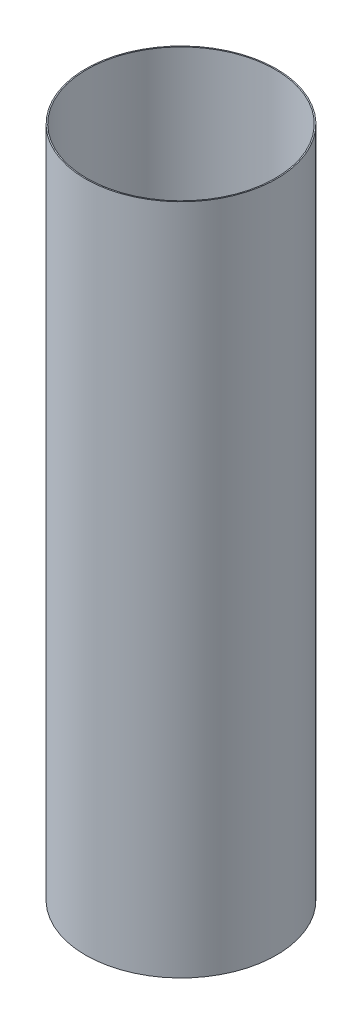
ISO-10303-21;
HEADER;
FILE_DESCRIPTION(('STEP AP214'),'2;1');
FILE_NAME('part.step','',(''),(''),'','','');
FILE_SCHEMA(('AUTOMOTIVE_DESIGN { 1 0 10303 214 1 1 1 1 }'));
ENDSEC;
DATA;
#1=APPLICATION_CONTEXT('core data for automotive mechanical design processes');
#2=APPLICATION_PROTOCOL_DEFINITION('international standard','automotive_design',2000,#1);
#3=PRODUCT_CONTEXT('',#1,'mechanical');
#4=PRODUCT('Part','Part','',(#3));
#5=PRODUCT_RELATED_PRODUCT_CATEGORY('part','',(#4));
#6=PRODUCT_DEFINITION_FORMATION('','',#4);
#7=PRODUCT_DEFINITION_CONTEXT('part definition',#1,'design');
#8=PRODUCT_DEFINITION('design','',#6,#7);
#9=PRODUCT_DEFINITION_SHAPE('','',#8);
#10=(LENGTH_UNIT() NAMED_UNIT(*) SI_UNIT(.MILLI.,.METRE.));
#11=(NAMED_UNIT(*) PLANE_ANGLE_UNIT() SI_UNIT($,.RADIAN.));
#12=(NAMED_UNIT(*) SI_UNIT($,.STERADIAN.) SOLID_ANGLE_UNIT());
#13=UNCERTAINTY_MEASURE_WITH_UNIT(LENGTH_MEASURE(1.E-05),#10,'distance_accuracy_value','');
#14=(GEOMETRIC_REPRESENTATION_CONTEXT(3) GLOBAL_UNCERTAINTY_ASSIGNED_CONTEXT((#13)) GLOBAL_UNIT_ASSIGNED_CONTEXT((#10,
#11,#12)) REPRESENTATION_CONTEXT('',''));
#15=CARTESIAN_POINT('',(0.,0.,0.));
#16=DIRECTION('',(0.,0.,1.));
#17=DIRECTION('',(1.,0.,0.));
#18=AXIS2_PLACEMENT_3D('',#15,#16,#17);
#19=CARTESIAN_POINT('',(0.,595.029544,0.));
#20=DIRECTION('',(0.,1.,0.));
#21=DIRECTION('',(0.,0.,1.));
#22=AXIS2_PLACEMENT_3D('',#19,#20,#21);
#23=PLANE('',#22);
#24=CARTESIAN_POINT('',(0.,595.029544,0.));
#25=DIRECTION('',(0.,1.,0.));
#26=DIRECTION('',(0.,0.,1.));
#27=AXIS2_PLACEMENT_3D('',#24,#25,#26);
#28=CIRCLE('',#27,84.455);
#29=CARTESIAN_POINT('',(0.,595.029544,84.455));
#30=VERTEX_POINT('',#29);
#31=EDGE_CURVE('E10',#30,#30,#28,.T.);
#32=ORIENTED_EDGE('',*,*,#31,.T.);
#33=EDGE_LOOP('',(#32));
#34=FACE_BOUND('',#33,.T.);
#35=CARTESIAN_POINT('',(0.,595.029544,0.));
#36=DIRECTION('',(0.,1.,0.));
#37=DIRECTION('',(0.,0.,1.));
#38=AXIS2_PLACEMENT_3D('',#35,#36,#37);
#39=CIRCLE('',#38,83.439);
#40=CARTESIAN_POINT('',(0.,595.029544,83.439));
#41=VERTEX_POINT('',#40);
#42=EDGE_CURVE('E44',#41,#41,#39,.T.);
#43=ORIENTED_EDGE('',*,*,#42,.F.);
#44=EDGE_LOOP('',(#43));
#45=FACE_BOUND('',#44,.T.);
#46=ADVANCED_FACE('F33',(#34,#45),#23,.T.);
#47=CARTESIAN_POINT('',(0.,0.,0.));
#48=DIRECTION('',(0.,1.,0.));
#49=DIRECTION('',(0.,0.,1.));
#50=AXIS2_PLACEMENT_3D('',#47,#48,#49);
#51=PLANE('',#50);
#52=CARTESIAN_POINT('',(0.,0.,0.));
#53=DIRECTION('',(0.,1.,0.));
#54=DIRECTION('',(0.,0.,1.));
#55=AXIS2_PLACEMENT_3D('',#52,#53,#54);
#56=CIRCLE('',#55,84.455);
#57=CARTESIAN_POINT('',(0.,0.,84.455));
#58=VERTEX_POINT('',#57);
#59=EDGE_CURVE('E37',#58,#58,#56,.T.);
#60=ORIENTED_EDGE('',*,*,#59,.F.);
#61=EDGE_LOOP('',(#60));
#62=FACE_BOUND('',#61,.T.);
#63=CARTESIAN_POINT('',(0.,0.,0.));
#64=DIRECTION('',(0.,1.,0.));
#65=DIRECTION('',(0.,0.,1.));
#66=AXIS2_PLACEMENT_3D('',#63,#64,#65);
#67=CIRCLE('',#66,83.439);
#68=CARTESIAN_POINT('',(0.,0.,83.439));
#69=VERTEX_POINT('',#68);
#70=EDGE_CURVE('E46',#69,#69,#67,.T.);
#71=ORIENTED_EDGE('',*,*,#70,.T.);
#72=EDGE_LOOP('',(#71));
#73=FACE_BOUND('',#72,.T.);
#74=ADVANCED_FACE('F56',(#62,#73),#51,.F.);
#75=CARTESIAN_POINT('',(0.,595.029544,0.));
#76=DIRECTION('',(0.,-1.,0.));
#77=DIRECTION('',(0.,0.,-1.));
#78=AXIS2_PLACEMENT_3D('',#75,#76,#77);
#79=CYLINDRICAL_SURFACE('',#78,84.455);
#80=ORIENTED_EDGE('',*,*,#31,.F.);
#81=EDGE_LOOP('',(#80));
#82=FACE_BOUND('',#81,.T.);
#83=ORIENTED_EDGE('',*,*,#59,.T.);
#84=EDGE_LOOP('',(#83));
#85=FACE_BOUND('',#84,.T.);
#86=ADVANCED_FACE('F35',(#82,#85),#79,.T.);
#87=CARTESIAN_POINT('',(0.,595.029544,0.));
#88=DIRECTION('',(0.,-1.,0.));
#89=DIRECTION('',(0.,0.,-1.));
#90=AXIS2_PLACEMENT_3D('',#87,#88,#89);
#91=CYLINDRICAL_SURFACE('',#90,83.439);
#92=ORIENTED_EDGE('',*,*,#42,.T.);
#93=EDGE_LOOP('',(#92));
#94=FACE_BOUND('',#93,.T.);
#95=ORIENTED_EDGE('',*,*,#70,.F.);
#96=EDGE_LOOP('',(#95));
#97=FACE_BOUND('',#96,.T.);
#98=ADVANCED_FACE('F52',(#94,#97),#91,.F.);
#99=CLOSED_SHELL('',(#46,#74,#86,#98));
#100=MANIFOLD_SOLID_BREP('B2',#99);
#101=ADVANCED_BREP_SHAPE_REPRESENTATION('',(#18,#100),#14);
#102=SHAPE_DEFINITION_REPRESENTATION(#9,#101);
ENDSEC;
END-ISO-10303-21;
